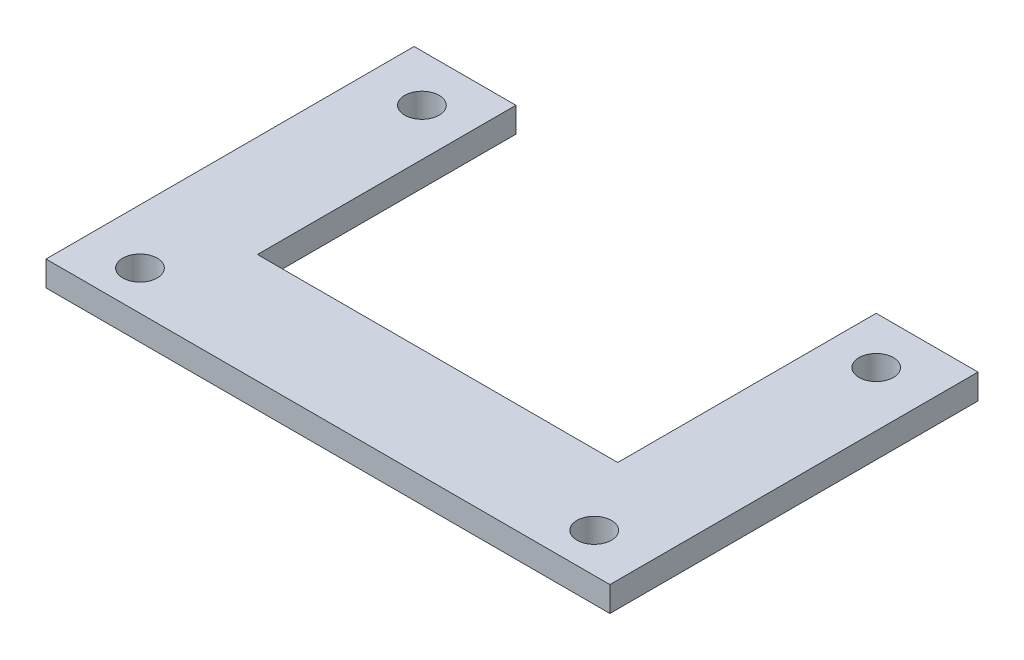
ISO-10303-21;
HEADER;
FILE_DESCRIPTION(('STEP AP214'),'2;1');
FILE_NAME('part.step','',(''),(''),'','','');
FILE_SCHEMA(('AUTOMOTIVE_DESIGN { 1 0 10303 214 1 1 1 1 }'));
ENDSEC;
DATA;
#1=APPLICATION_CONTEXT('core data for automotive mechanical design processes');
#2=APPLICATION_PROTOCOL_DEFINITION('international standard','automotive_design',2000,#1);
#3=PRODUCT_CONTEXT('',#1,'mechanical');
#4=PRODUCT('Part','Part','',(#3));
#5=PRODUCT_RELATED_PRODUCT_CATEGORY('part','',(#4));
#6=PRODUCT_DEFINITION_FORMATION('','',#4);
#7=PRODUCT_DEFINITION_CONTEXT('part definition',#1,'design');
#8=PRODUCT_DEFINITION('design','',#6,#7);
#9=PRODUCT_DEFINITION_SHAPE('','',#8);
#10=(LENGTH_UNIT() NAMED_UNIT(*) SI_UNIT(.MILLI.,.METRE.));
#11=(NAMED_UNIT(*) PLANE_ANGLE_UNIT() SI_UNIT($,.RADIAN.));
#12=(NAMED_UNIT(*) SI_UNIT($,.STERADIAN.) SOLID_ANGLE_UNIT());
#13=UNCERTAINTY_MEASURE_WITH_UNIT(LENGTH_MEASURE(1.E-05),#10,'distance_accuracy_value','');
#14=(GEOMETRIC_REPRESENTATION_CONTEXT(3) GLOBAL_UNCERTAINTY_ASSIGNED_CONTEXT((#13)) GLOBAL_UNIT_ASSIGNED_CONTEXT((#10,
#11,#12)) REPRESENTATION_CONTEXT('',''));
#15=CARTESIAN_POINT('',(0.,0.,0.));
#16=DIRECTION('',(0.,0.,1.));
#17=DIRECTION('',(1.,0.,0.));
#18=AXIS2_PLACEMENT_3D('',#15,#16,#17);
#19=CARTESIAN_POINT('',(0.,1.6,0.));
#20=DIRECTION('',(0.,0.,1.));
#21=DIRECTION('',(1.,0.,0.));
#22=AXIS2_PLACEMENT_3D('',#19,#20,#21);
#23=PLANE('',#22);
#24=DIRECTION('',(-1.,0.,0.));
#25=VECTOR('',#24,1.);
#26=CARTESIAN_POINT('',(0.,1.6,0.));
#27=LINE('',#26,#25);
#28=CARTESIAN_POINT('',(6.5,1.6,0.));
#29=VERTEX_POINT('',#28);
#30=CARTESIAN_POINT('',(0.,1.6,0.));
#31=VERTEX_POINT('',#30);
#32=EDGE_CURVE('E126',#29,#31,#27,.T.);
#33=ORIENTED_EDGE('',*,*,#32,.F.);
#34=DIRECTION('',(0.,1.,0.));
#35=VECTOR('',#34,1.);
#36=CARTESIAN_POINT('',(6.5,-1.4,0.));
#37=LINE('',#36,#35);
#38=CARTESIAN_POINT('',(6.5,0.,0.));
#39=VERTEX_POINT('',#38);
#40=EDGE_CURVE('E180',#39,#29,#37,.T.);
#41=ORIENTED_EDGE('',*,*,#40,.F.);
#42=DIRECTION('',(-1.,0.,0.));
#43=VECTOR('',#42,1.);
#44=CARTESIAN_POINT('',(0.,0.,0.));
#45=LINE('',#44,#43);
#46=CARTESIAN_POINT('',(0.,0.,0.));
#47=VERTEX_POINT('',#46);
#48=EDGE_CURVE('E146',#39,#47,#45,.T.);
#49=ORIENTED_EDGE('',*,*,#48,.T.);
#50=DIRECTION('',(0.,-1.,0.));
#51=VECTOR('',#50,1.);
#52=CARTESIAN_POINT('',(0.,1.6,0.));
#53=LINE('',#52,#51);
#54=EDGE_CURVE('E137',#31,#47,#53,.T.);
#55=ORIENTED_EDGE('',*,*,#54,.F.);
#56=EDGE_LOOP('',(#33,#41,#49,#55));
#57=FACE_BOUND('',#56,.T.);
#58=ADVANCED_FACE('F38',(#57),#23,.F.);
#59=CARTESIAN_POINT('',(0.,1.6,0.));
#60=DIRECTION('',(1.,0.,0.));
#61=DIRECTION('',(0.,0.,-1.));
#62=AXIS2_PLACEMENT_3D('',#59,#60,#61);
#63=PLANE('',#62);
#64=DIRECTION('',(0.,0.,1.));
#65=VECTOR('',#64,1.);
#66=CARTESIAN_POINT('',(0.,0.,0.));
#67=LINE('',#66,#65);
#68=CARTESIAN_POINT('',(0.,0.,23.5));
#69=VERTEX_POINT('',#68);
#70=EDGE_CURVE('E138',#47,#69,#67,.T.);
#71=ORIENTED_EDGE('',*,*,#70,.T.);
#72=DIRECTION('',(0.,1.,0.));
#73=VECTOR('',#72,1.);
#74=CARTESIAN_POINT('',(0.,-1.4,23.5));
#75=LINE('',#74,#73);
#76=CARTESIAN_POINT('',(0.,1.6,23.5));
#77=VERTEX_POINT('',#76);
#78=EDGE_CURVE('E54',#69,#77,#75,.T.);
#79=ORIENTED_EDGE('',*,*,#78,.T.);
#80=DIRECTION('',(0.,0.,1.));
#81=VECTOR('',#80,1.);
#82=CARTESIAN_POINT('',(0.,1.6,0.));
#83=LINE('',#82,#81);
#84=EDGE_CURVE('E118',#31,#77,#83,.T.);
#85=ORIENTED_EDGE('',*,*,#84,.F.);
#86=ORIENTED_EDGE('',*,*,#54,.T.);
#87=EDGE_LOOP('',(#71,#79,#85,#86));
#88=FACE_BOUND('',#87,.T.);
#89=ADVANCED_FACE('F40',(#88),#63,.F.);
#90=CARTESIAN_POINT('',(36.,1.6,0.));
#91=DIRECTION('',(-1.,0.,0.));
#92=DIRECTION('',(0.,0.,1.));
#93=AXIS2_PLACEMENT_3D('',#90,#91,#92);
#94=PLANE('',#93);
#95=DIRECTION('',(0.,0.,-1.));
#96=VECTOR('',#95,1.);
#97=CARTESIAN_POINT('',(36.,1.6,0.));
#98=LINE('',#97,#96);
#99=CARTESIAN_POINT('',(36.,1.6,23.5));
#100=VERTEX_POINT('',#99);
#101=CARTESIAN_POINT('',(36.,1.6,0.));
#102=VERTEX_POINT('',#101);
#103=EDGE_CURVE('E115',#100,#102,#98,.T.);
#104=ORIENTED_EDGE('',*,*,#103,.F.);
#105=DIRECTION('',(0.,1.,0.));
#106=VECTOR('',#105,1.);
#107=CARTESIAN_POINT('',(36.,-1.4,23.5));
#108=LINE('',#107,#106);
#109=CARTESIAN_POINT('',(36.,0.,23.5));
#110=VERTEX_POINT('',#109);
#111=EDGE_CURVE('E101',#110,#100,#108,.T.);
#112=ORIENTED_EDGE('',*,*,#111,.F.);
#113=DIRECTION('',(0.,0.,-1.));
#114=VECTOR('',#113,1.);
#115=CARTESIAN_POINT('',(36.,0.,0.));
#116=LINE('',#115,#114);
#117=CARTESIAN_POINT('',(36.,0.,0.));
#118=VERTEX_POINT('',#117);
#119=EDGE_CURVE('E142',#110,#118,#116,.T.);
#120=ORIENTED_EDGE('',*,*,#119,.T.);
#121=DIRECTION('',(0.,-1.,0.));
#122=VECTOR('',#121,1.);
#123=CARTESIAN_POINT('',(36.,1.6,0.));
#124=LINE('',#123,#122);
#125=EDGE_CURVE('E123',#102,#118,#124,.T.);
#126=ORIENTED_EDGE('',*,*,#125,.F.);
#127=EDGE_LOOP('',(#104,#112,#120,#126));
#128=FACE_BOUND('',#127,.T.);
#129=ADVANCED_FACE('F121',(#128),#94,.F.);
#130=CARTESIAN_POINT('',(29.5,0.,0.));
#131=VERTEX_POINT('',#130);
#132=EDGE_CURVE('E132',#118,#131,#45,.T.);
#133=ORIENTED_EDGE('',*,*,#132,.T.);
#134=DIRECTION('',(0.,1.,0.));
#135=VECTOR('',#134,1.);
#136=CARTESIAN_POINT('',(29.5,-1.4,0.));
#137=LINE('',#136,#135);
#138=CARTESIAN_POINT('',(29.5,1.6,0.));
#139=VERTEX_POINT('',#138);
#140=EDGE_CURVE('E172',#131,#139,#137,.T.);
#141=ORIENTED_EDGE('',*,*,#140,.T.);
#142=EDGE_CURVE('E130',#102,#139,#27,.T.);
#143=ORIENTED_EDGE('',*,*,#142,.F.);
#144=ORIENTED_EDGE('',*,*,#125,.T.);
#145=EDGE_LOOP('',(#133,#141,#143,#144));
#146=FACE_BOUND('',#145,.T.);
#147=ADVANCED_FACE('F171',(#146),#23,.F.);
#148=CARTESIAN_POINT('',(0.,1.6,0.));
#149=DIRECTION('',(0.,1.,0.));
#150=DIRECTION('',(0.,0.,1.));
#151=AXIS2_PLACEMENT_3D('',#148,#149,#150);
#152=PLANE('',#151);
#153=DIRECTION('',(-1.,0.,0.));
#154=VECTOR('',#153,1.);
#155=CARTESIAN_POINT('',(0.,1.6,23.5));
#156=LINE('',#155,#154);
#157=EDGE_CURVE('E104',#100,#77,#156,.T.);
#158=ORIENTED_EDGE('',*,*,#157,.F.);
#159=ORIENTED_EDGE('',*,*,#103,.T.);
#160=ORIENTED_EDGE('',*,*,#142,.T.);
#161=DIRECTION('',(0.,0.,-1.));
#162=VECTOR('',#161,1.);
#163=CARTESIAN_POINT('',(29.5,1.6,16.5));
#164=LINE('',#163,#162);
#165=CARTESIAN_POINT('',(29.5,1.6,16.5));
#166=VERTEX_POINT('',#165);
#167=EDGE_CURVE('E175',#166,#139,#164,.T.);
#168=ORIENTED_EDGE('',*,*,#167,.F.);
#169=DIRECTION('',(1.,0.,0.));
#170=VECTOR('',#169,1.);
#171=CARTESIAN_POINT('',(6.5,1.6,16.5));
#172=LINE('',#171,#170);
#173=CARTESIAN_POINT('',(6.5,1.6,16.5));
#174=VERTEX_POINT('',#173);
#175=EDGE_CURVE('E178',#174,#166,#172,.T.);
#176=ORIENTED_EDGE('',*,*,#175,.F.);
#177=DIRECTION('',(0.,0.,1.));
#178=VECTOR('',#177,1.);
#179=CARTESIAN_POINT('',(6.5,1.6,0.));
#180=LINE('',#179,#178);
#181=EDGE_CURVE('E185',#29,#174,#180,.T.);
#182=ORIENTED_EDGE('',*,*,#181,.F.);
#183=ORIENTED_EDGE('',*,*,#32,.T.);
#184=ORIENTED_EDGE('',*,*,#84,.T.);
#185=EDGE_LOOP('',(#158,#159,#160,#168,#176,#182,#183,#184));
#186=FACE_BOUND('',#185,.T.);
#187=CARTESIAN_POINT('',(32.5,1.6,3.));
#188=DIRECTION('',(0.,1.,0.));
#189=DIRECTION('',(0.,0.,1.));
#190=AXIS2_PLACEMENT_3D('',#187,#188,#189);
#191=CIRCLE('',#190,1.10000000000001);
#192=CARTESIAN_POINT('',(32.5,1.6,4.10000000000001));
#193=VERTEX_POINT('',#192);
#194=EDGE_CURVE('E210',#193,#193,#191,.T.);
#195=ORIENTED_EDGE('',*,*,#194,.F.);
#196=EDGE_LOOP('',(#195));
#197=FACE_BOUND('',#196,.T.);
#198=CARTESIAN_POINT('',(3.5,1.6,21.));
#199=DIRECTION('',(0.,1.,0.));
#200=DIRECTION('',(0.,0.,1.));
#201=AXIS2_PLACEMENT_3D('',#198,#199,#200);
#202=CIRCLE('',#201,1.1);
#203=CARTESIAN_POINT('',(3.5,1.6,22.1));
#204=VERTEX_POINT('',#203);
#205=EDGE_CURVE('E201',#204,#204,#202,.T.);
#206=ORIENTED_EDGE('',*,*,#205,.F.);
#207=EDGE_LOOP('',(#206));
#208=FACE_BOUND('',#207,.T.);
#209=CARTESIAN_POINT('',(32.5,1.6,21.));
#210=DIRECTION('',(0.,1.,0.));
#211=DIRECTION('',(0.,0.,1.));
#212=AXIS2_PLACEMENT_3D('',#209,#210,#211);
#213=CIRCLE('',#212,1.10000000000001);
#214=CARTESIAN_POINT('',(32.5,1.6,22.1));
#215=VERTEX_POINT('',#214);
#216=EDGE_CURVE('E191',#215,#215,#213,.T.);
#217=ORIENTED_EDGE('',*,*,#216,.F.);
#218=EDGE_LOOP('',(#217));
#219=FACE_BOUND('',#218,.T.);
#220=CARTESIAN_POINT('',(3.5,1.6,3.));
#221=DIRECTION('',(0.,1.,0.));
#222=DIRECTION('',(0.,0.,1.));
#223=AXIS2_PLACEMENT_3D('',#220,#221,#222);
#224=CIRCLE('',#223,1.1);
#225=CARTESIAN_POINT('',(3.5,1.6,4.1));
#226=VERTEX_POINT('',#225);
#227=EDGE_CURVE('E209',#226,#226,#224,.T.);
#228=ORIENTED_EDGE('',*,*,#227,.F.);
#229=EDGE_LOOP('',(#228));
#230=FACE_BOUND('',#229,.T.);
#231=ADVANCED_FACE('F112',(#186,#197,#208,#219,#230),#152,.T.);
#232=CARTESIAN_POINT('',(0.,0.,0.));
#233=DIRECTION('',(0.,1.,0.));
#234=DIRECTION('',(0.,0.,1.));
#235=AXIS2_PLACEMENT_3D('',#232,#233,#234);
#236=PLANE('',#235);
#237=CARTESIAN_POINT('',(32.5,0.,3.));
#238=DIRECTION('',(0.,1.,0.));
#239=DIRECTION('',(0.,0.,1.));
#240=AXIS2_PLACEMENT_3D('',#237,#238,#239);
#241=CIRCLE('',#240,1.10000000000001);
#242=CARTESIAN_POINT('',(32.5,0.,4.10000000000001));
#243=VERTEX_POINT('',#242);
#244=EDGE_CURVE('E205',#243,#243,#241,.T.);
#245=ORIENTED_EDGE('',*,*,#244,.T.);
#246=EDGE_LOOP('',(#245));
#247=FACE_BOUND('',#246,.T.);
#248=CARTESIAN_POINT('',(3.5,0.,21.));
#249=DIRECTION('',(0.,1.,0.));
#250=DIRECTION('',(0.,0.,1.));
#251=AXIS2_PLACEMENT_3D('',#248,#249,#250);
#252=CIRCLE('',#251,1.1);
#253=CARTESIAN_POINT('',(3.5,0.,22.1));
#254=VERTEX_POINT('',#253);
#255=EDGE_CURVE('E214',#254,#254,#252,.T.);
#256=ORIENTED_EDGE('',*,*,#255,.T.);
#257=EDGE_LOOP('',(#256));
#258=FACE_BOUND('',#257,.T.);
#259=CARTESIAN_POINT('',(32.5,0.,21.));
#260=DIRECTION('',(0.,1.,0.));
#261=DIRECTION('',(0.,0.,1.));
#262=AXIS2_PLACEMENT_3D('',#259,#260,#261);
#263=CIRCLE('',#262,1.10000000000001);
#264=CARTESIAN_POINT('',(32.5,0.,22.1));
#265=VERTEX_POINT('',#264);
#266=EDGE_CURVE('E197',#265,#265,#263,.T.);
#267=ORIENTED_EDGE('',*,*,#266,.T.);
#268=EDGE_LOOP('',(#267));
#269=FACE_BOUND('',#268,.T.);
#270=CARTESIAN_POINT('',(3.5,0.,3.));
#271=DIRECTION('',(0.,1.,0.));
#272=DIRECTION('',(0.,0.,1.));
#273=AXIS2_PLACEMENT_3D('',#270,#271,#272);
#274=CIRCLE('',#273,1.1);
#275=CARTESIAN_POINT('',(3.5,0.,4.1));
#276=VERTEX_POINT('',#275);
#277=EDGE_CURVE('E143',#276,#276,#274,.T.);
#278=ORIENTED_EDGE('',*,*,#277,.T.);
#279=EDGE_LOOP('',(#278));
#280=FACE_BOUND('',#279,.T.);
#281=ORIENTED_EDGE('',*,*,#119,.F.);
#282=DIRECTION('',(-1.,0.,0.));
#283=VECTOR('',#282,1.);
#284=CARTESIAN_POINT('',(0.,0.,23.5));
#285=LINE('',#284,#283);
#286=EDGE_CURVE('E11',#110,#69,#285,.T.);
#287=ORIENTED_EDGE('',*,*,#286,.T.);
#288=ORIENTED_EDGE('',*,*,#70,.F.);
#289=ORIENTED_EDGE('',*,*,#48,.F.);
#290=DIRECTION('',(0.,0.,1.));
#291=VECTOR('',#290,1.);
#292=CARTESIAN_POINT('',(6.5,0.,0.));
#293=LINE('',#292,#291);
#294=CARTESIAN_POINT('',(6.5,0.,16.5));
#295=VERTEX_POINT('',#294);
#296=EDGE_CURVE('E155',#39,#295,#293,.T.);
#297=ORIENTED_EDGE('',*,*,#296,.T.);
#298=DIRECTION('',(1.,0.,0.));
#299=VECTOR('',#298,1.);
#300=CARTESIAN_POINT('',(0.,0.,16.5));
#301=LINE('',#300,#299);
#302=CARTESIAN_POINT('',(29.5,0.,16.5));
#303=VERTEX_POINT('',#302);
#304=EDGE_CURVE('E159',#295,#303,#301,.T.);
#305=ORIENTED_EDGE('',*,*,#304,.T.);
#306=DIRECTION('',(0.,0.,-1.));
#307=VECTOR('',#306,1.);
#308=CARTESIAN_POINT('',(29.5,0.,0.));
#309=LINE('',#308,#307);
#310=EDGE_CURVE('E47',#303,#131,#309,.T.);
#311=ORIENTED_EDGE('',*,*,#310,.T.);
#312=ORIENTED_EDGE('',*,*,#132,.F.);
#313=EDGE_LOOP('',(#281,#287,#288,#289,#297,#305,#311,#312));
#314=FACE_BOUND('',#313,.T.);
#315=ADVANCED_FACE('F166',(#247,#258,#269,#280,#314),#236,.F.);
#316=CARTESIAN_POINT('',(3.5,0.,3.));
#317=DIRECTION('',(0.,1.,0.));
#318=DIRECTION('',(0.,0.,1.));
#319=AXIS2_PLACEMENT_3D('',#316,#317,#318);
#320=CYLINDRICAL_SURFACE('',#319,1.1);
#321=ORIENTED_EDGE('',*,*,#277,.F.);
#322=EDGE_LOOP('',(#321));
#323=FACE_BOUND('',#322,.T.);
#324=ORIENTED_EDGE('',*,*,#227,.T.);
#325=EDGE_LOOP('',(#324));
#326=FACE_BOUND('',#325,.T.);
#327=ADVANCED_FACE('F227',(#323,#326),#320,.F.);
#328=CARTESIAN_POINT('',(32.5,0.,21.));
#329=DIRECTION('',(0.,1.,0.));
#330=DIRECTION('',(0.,0.,1.));
#331=AXIS2_PLACEMENT_3D('',#328,#329,#330);
#332=CYLINDRICAL_SURFACE('',#331,1.10000000000001);
#333=ORIENTED_EDGE('',*,*,#266,.F.);
#334=EDGE_LOOP('',(#333));
#335=FACE_BOUND('',#334,.T.);
#336=ORIENTED_EDGE('',*,*,#216,.T.);
#337=EDGE_LOOP('',(#336));
#338=FACE_BOUND('',#337,.T.);
#339=ADVANCED_FACE('F311',(#335,#338),#332,.F.);
#340=CARTESIAN_POINT('',(3.5,0.,21.));
#341=DIRECTION('',(0.,1.,0.));
#342=DIRECTION('',(0.,0.,1.));
#343=AXIS2_PLACEMENT_3D('',#340,#341,#342);
#344=CYLINDRICAL_SURFACE('',#343,1.1);
#345=ORIENTED_EDGE('',*,*,#255,.F.);
#346=EDGE_LOOP('',(#345));
#347=FACE_BOUND('',#346,.T.);
#348=ORIENTED_EDGE('',*,*,#205,.T.);
#349=EDGE_LOOP('',(#348));
#350=FACE_BOUND('',#349,.T.);
#351=ADVANCED_FACE('F318',(#347,#350),#344,.F.);
#352=CARTESIAN_POINT('',(32.5,0.,3.));
#353=DIRECTION('',(0.,1.,0.));
#354=DIRECTION('',(0.,0.,1.));
#355=AXIS2_PLACEMENT_3D('',#352,#353,#354);
#356=CYLINDRICAL_SURFACE('',#355,1.10000000000001);
#357=ORIENTED_EDGE('',*,*,#244,.F.);
#358=EDGE_LOOP('',(#357));
#359=FACE_BOUND('',#358,.T.);
#360=ORIENTED_EDGE('',*,*,#194,.T.);
#361=EDGE_LOOP('',(#360));
#362=FACE_BOUND('',#361,.T.);
#363=ADVANCED_FACE('F283',(#359,#362),#356,.F.);
#364=CARTESIAN_POINT('',(29.5,-1.4,16.5));
#365=DIRECTION('',(1.,0.,0.));
#366=DIRECTION('',(0.,0.,-1.));
#367=AXIS2_PLACEMENT_3D('',#364,#365,#366);
#368=PLANE('',#367);
#369=DIRECTION('',(0.,1.,0.));
#370=VECTOR('',#369,1.);
#371=CARTESIAN_POINT('',(29.5,-1.4,16.5));
#372=LINE('',#371,#370);
#373=EDGE_CURVE('E192',#303,#166,#372,.T.);
#374=ORIENTED_EDGE('',*,*,#373,.T.);
#375=ORIENTED_EDGE('',*,*,#167,.T.);
#376=ORIENTED_EDGE('',*,*,#140,.F.);
#377=ORIENTED_EDGE('',*,*,#310,.F.);
#378=EDGE_LOOP('',(#374,#375,#376,#377));
#379=FACE_BOUND('',#378,.T.);
#380=ADVANCED_FACE('F274',(#379),#368,.F.);
#381=CARTESIAN_POINT('',(6.5,-1.4,16.5));
#382=DIRECTION('',(0.,0.,1.));
#383=DIRECTION('',(1.,0.,0.));
#384=AXIS2_PLACEMENT_3D('',#381,#382,#383);
#385=PLANE('',#384);
#386=DIRECTION('',(0.,1.,0.));
#387=VECTOR('',#386,1.);
#388=CARTESIAN_POINT('',(6.5,-1.4,16.5));
#389=LINE('',#388,#387);
#390=EDGE_CURVE('E61',#295,#174,#389,.T.);
#391=ORIENTED_EDGE('',*,*,#390,.T.);
#392=ORIENTED_EDGE('',*,*,#175,.T.);
#393=ORIENTED_EDGE('',*,*,#373,.F.);
#394=ORIENTED_EDGE('',*,*,#304,.F.);
#395=EDGE_LOOP('',(#391,#392,#393,#394));
#396=FACE_BOUND('',#395,.T.);
#397=ADVANCED_FACE('F263',(#396),#385,.F.);
#398=CARTESIAN_POINT('',(6.5,-1.4,0.));
#399=DIRECTION('',(-1.,0.,0.));
#400=DIRECTION('',(0.,0.,1.));
#401=AXIS2_PLACEMENT_3D('',#398,#399,#400);
#402=PLANE('',#401);
#403=ORIENTED_EDGE('',*,*,#40,.T.);
#404=ORIENTED_EDGE('',*,*,#181,.T.);
#405=ORIENTED_EDGE('',*,*,#390,.F.);
#406=ORIENTED_EDGE('',*,*,#296,.F.);
#407=EDGE_LOOP('',(#403,#404,#405,#406));
#408=FACE_BOUND('',#407,.T.);
#409=ADVANCED_FACE('F258',(#408),#402,.F.);
#410=CARTESIAN_POINT('',(0.,-1.4,23.5));
#411=DIRECTION('',(0.,0.,-1.));
#412=DIRECTION('',(-1.,0.,0.));
#413=AXIS2_PLACEMENT_3D('',#410,#411,#412);
#414=PLANE('',#413);
#415=ORIENTED_EDGE('',*,*,#111,.T.);
#416=ORIENTED_EDGE('',*,*,#157,.T.);
#417=ORIENTED_EDGE('',*,*,#78,.F.);
#418=ORIENTED_EDGE('',*,*,#286,.F.);
#419=EDGE_LOOP('',(#415,#416,#417,#418));
#420=FACE_BOUND('',#419,.T.);
#421=ADVANCED_FACE('F103',(#420),#414,.F.);
#422=CLOSED_SHELL('',(#58,#89,#129,#147,#231,#315,#327,#339,#351,#363,#380,#397,#409,#421));
#423=MANIFOLD_SOLID_BREP('B2',#422);
#424=ADVANCED_BREP_SHAPE_REPRESENTATION('',(#18,#423),#14);
#425=SHAPE_DEFINITION_REPRESENTATION(#9,#424);
ENDSEC;
END-ISO-10303-21;
